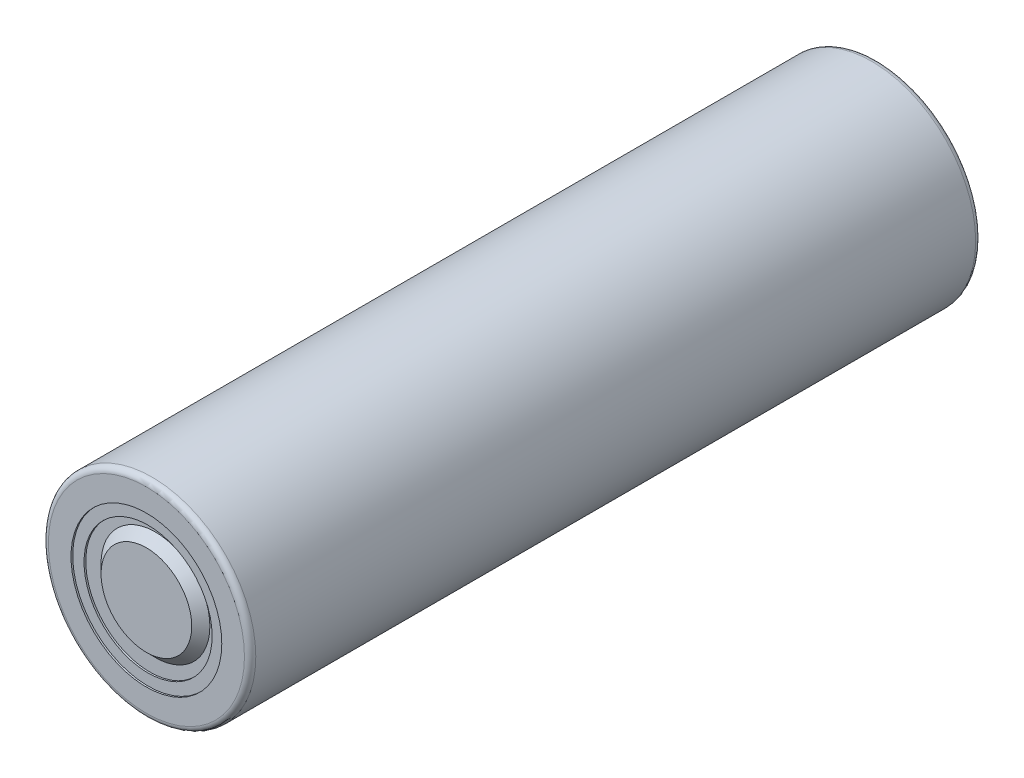
ISO-10303-21;
HEADER;
FILE_DESCRIPTION(('STEP AP214'),'2;1');
FILE_NAME('part.step','',(''),(''),'','','');
FILE_SCHEMA(('AUTOMOTIVE_DESIGN { 1 0 10303 214 1 1 1 1 }'));
ENDSEC;
DATA;
#1=APPLICATION_CONTEXT('core data for automotive mechanical design processes');
#2=APPLICATION_PROTOCOL_DEFINITION('international standard','automotive_design',2000,#1);
#3=PRODUCT_CONTEXT('',#1,'mechanical');
#4=PRODUCT('Part','Part','',(#3));
#5=PRODUCT_RELATED_PRODUCT_CATEGORY('part','',(#4));
#6=PRODUCT_DEFINITION_FORMATION('','',#4);
#7=PRODUCT_DEFINITION_CONTEXT('part definition',#1,'design');
#8=PRODUCT_DEFINITION('design','',#6,#7);
#9=PRODUCT_DEFINITION_SHAPE('','',#8);
#10=(LENGTH_UNIT() NAMED_UNIT(*) SI_UNIT(.MILLI.,.METRE.));
#11=(NAMED_UNIT(*) PLANE_ANGLE_UNIT() SI_UNIT($,.RADIAN.));
#12=(NAMED_UNIT(*) SI_UNIT($,.STERADIAN.) SOLID_ANGLE_UNIT());
#13=UNCERTAINTY_MEASURE_WITH_UNIT(LENGTH_MEASURE(1.E-05),#10,'distance_accuracy_value','');
#14=(GEOMETRIC_REPRESENTATION_CONTEXT(3) GLOBAL_UNCERTAINTY_ASSIGNED_CONTEXT((#13)) GLOBAL_UNIT_ASSIGNED_CONTEXT((#10,
#11,#12)) REPRESENTATION_CONTEXT('',''));
#15=CARTESIAN_POINT('',(0.,0.,0.));
#16=DIRECTION('',(0.,0.,1.));
#17=DIRECTION('',(1.,0.,0.));
#18=AXIS2_PLACEMENT_3D('',#15,#16,#17);
#19=CARTESIAN_POINT('',(0.,0.,64.5));
#20=DIRECTION('',(0.,0.,-1.));
#21=DIRECTION('',(-1.,0.,0.));
#22=AXIS2_PLACEMENT_3D('',#19,#20,#21);
#23=CYLINDRICAL_SURFACE('',#22,9.1499999984872);
#24=CARTESIAN_POINT('',(0.,0.,0.5));
#25=DIRECTION('',(0.,0.,1.));
#26=DIRECTION('',(1.,0.,0.));
#27=AXIS2_PLACEMENT_3D('',#24,#25,#26);
#28=CIRCLE('',#27,9.1499999984872);
#29=CARTESIAN_POINT('',(9.1499999984872,0.,0.5));
#30=VERTEX_POINT('',#29);
#31=EDGE_CURVE('E44',#30,#30,#28,.T.);
#32=ORIENTED_EDGE('',*,*,#31,.T.);
#33=EDGE_LOOP('',(#32));
#34=FACE_BOUND('',#33,.T.);
#35=CARTESIAN_POINT('',(0.,0.,64.));
#36=DIRECTION('',(0.,0.,1.));
#37=DIRECTION('',(1.,0.,0.));
#38=AXIS2_PLACEMENT_3D('',#35,#36,#37);
#39=CIRCLE('',#38,9.1499999984872);
#40=CARTESIAN_POINT('',(9.1499999984872,0.,64.));
#41=VERTEX_POINT('',#40);
#42=EDGE_CURVE('E48',#41,#41,#39,.F.);
#43=ORIENTED_EDGE('',*,*,#42,.T.);
#44=EDGE_LOOP('',(#43));
#45=FACE_BOUND('',#44,.T.);
#46=ADVANCED_FACE('F33',(#34,#45),#23,.T.);
#47=CARTESIAN_POINT('',(0.,0.,64.5));
#48=DIRECTION('',(0.,0.,1.));
#49=DIRECTION('',(1.,0.,0.));
#50=AXIS2_PLACEMENT_3D('',#47,#48,#49);
#51=PLANE('',#50);
#52=CARTESIAN_POINT('',(0.,0.,64.5));
#53=DIRECTION('',(0.,0.,1.));
#54=DIRECTION('',(1.,0.,0.));
#55=AXIS2_PLACEMENT_3D('',#52,#53,#54);
#56=CIRCLE('',#55,8.6499999984872);
#57=CARTESIAN_POINT('',(8.6499999984872,0.,64.5));
#58=VERTEX_POINT('',#57);
#59=EDGE_CURVE('E10',#58,#58,#56,.T.);
#60=ORIENTED_EDGE('',*,*,#59,.T.);
#61=EDGE_LOOP('',(#60));
#62=FACE_BOUND('',#61,.T.);
#63=CARTESIAN_POINT('',(0.,0.,64.5));
#64=DIRECTION('',(0.,0.,1.));
#65=DIRECTION('',(1.,0.,0.));
#66=AXIS2_PLACEMENT_3D('',#63,#64,#65);
#67=CIRCLE('',#66,6.65000000132933);
#68=CARTESIAN_POINT('',(6.65000000132933,0.,64.5));
#69=VERTEX_POINT('',#68);
#70=EDGE_CURVE('E71',#69,#69,#67,.T.);
#71=ORIENTED_EDGE('',*,*,#70,.F.);
#72=EDGE_LOOP('',(#71));
#73=FACE_BOUND('',#72,.T.);
#74=ADVANCED_FACE('F100',(#62,#73),#51,.T.);
#75=CARTESIAN_POINT('',(0.,0.,0.));
#76=DIRECTION('',(0.,0.,1.));
#77=DIRECTION('',(1.,0.,0.));
#78=AXIS2_PLACEMENT_3D('',#75,#76,#77);
#79=PLANE('',#78);
#80=CARTESIAN_POINT('',(0.,0.,0.));
#81=DIRECTION('',(0.,0.,1.));
#82=DIRECTION('',(1.,0.,0.));
#83=AXIS2_PLACEMENT_3D('',#80,#81,#82);
#84=CIRCLE('',#83,8.6499999984872);
#85=CARTESIAN_POINT('',(8.6499999984872,0.,0.));
#86=VERTEX_POINT('',#85);
#87=EDGE_CURVE('E40',#86,#86,#84,.F.);
#88=ORIENTED_EDGE('',*,*,#87,.T.);
#89=EDGE_LOOP('',(#88));
#90=FACE_BOUND('',#89,.T.);
#91=CARTESIAN_POINT('',(0.,0.,0.));
#92=DIRECTION('',(0.,0.,1.));
#93=DIRECTION('',(1.,0.,0.));
#94=AXIS2_PLACEMENT_3D('',#91,#92,#93);
#95=CIRCLE('',#94,7.14999999952627);
#96=CARTESIAN_POINT('',(7.14999999952627,0.,0.));
#97=VERTEX_POINT('',#96);
#98=EDGE_CURVE('E54',#97,#97,#95,.T.);
#99=ORIENTED_EDGE('',*,*,#98,.T.);
#100=EDGE_LOOP('',(#99));
#101=FACE_BOUND('',#100,.T.);
#102=ADVANCED_FACE('F110',(#90,#101),#79,.F.);
#103=CARTESIAN_POINT('',(0.,0.,0.2));
#104=DIRECTION('',(0.,0.,-1.));
#105=DIRECTION('',(-1.,0.,0.));
#106=AXIS2_PLACEMENT_3D('',#103,#104,#105);
#107=CYLINDRICAL_SURFACE('',#106,7.14999999952627);
#108=CARTESIAN_POINT('',(0.,0.,0.2));
#109=DIRECTION('',(0.,0.,1.));
#110=DIRECTION('',(1.,0.,0.));
#111=AXIS2_PLACEMENT_3D('',#108,#109,#110);
#112=CIRCLE('',#111,7.14999999952627);
#113=CARTESIAN_POINT('',(7.14999999952627,0.,0.2));
#114=VERTEX_POINT('',#113);
#115=EDGE_CURVE('E53',#114,#114,#112,.T.);
#116=ORIENTED_EDGE('',*,*,#115,.T.);
#117=EDGE_LOOP('',(#116));
#118=FACE_BOUND('',#117,.T.);
#119=ORIENTED_EDGE('',*,*,#98,.F.);
#120=EDGE_LOOP('',(#119));
#121=FACE_BOUND('',#120,.T.);
#122=ADVANCED_FACE('F139',(#118,#121),#107,.F.);
#123=CARTESIAN_POINT('',(0.,0.,0.2));
#124=DIRECTION('',(0.,0.,1.));
#125=DIRECTION('',(1.,0.,0.));
#126=AXIS2_PLACEMENT_3D('',#123,#124,#125);
#127=PLANE('',#126);
#128=ORIENTED_EDGE('',*,*,#115,.F.);
#129=EDGE_LOOP('',(#128));
#130=FACE_BOUND('',#129,.T.);
#131=ADVANCED_FACE('F217',(#130),#127,.F.);
#132=CARTESIAN_POINT('',(-5.64999999876227,0.,64.2));
#133=DIRECTION('',(0.,0.,-1.));
#134=DIRECTION('',(-1.,0.,0.));
#135=AXIS2_PLACEMENT_3D('',#132,#133,#134);
#136=PLANE('',#135);
#137=CARTESIAN_POINT('',(0.,0.,64.2));
#138=DIRECTION('',(0.,0.,1.));
#139=DIRECTION('',(1.,0.,0.));
#140=AXIS2_PLACEMENT_3D('',#137,#138,#139);
#141=CIRCLE('',#140,5.64999999876227);
#142=CARTESIAN_POINT('',(5.64999999876227,0.,64.2));
#143=VERTEX_POINT('',#142);
#144=EDGE_CURVE('E80',#143,#143,#141,.T.);
#145=ORIENTED_EDGE('',*,*,#144,.T.);
#146=EDGE_LOOP('',(#145));
#147=FACE_BOUND('',#146,.T.);
#148=CARTESIAN_POINT('',(0.,0.,64.2));
#149=DIRECTION('',(0.,0.,1.));
#150=DIRECTION('',(1.,0.,0.));
#151=AXIS2_PLACEMENT_3D('',#148,#149,#150);
#152=CIRCLE('',#151,8.14999999865253);
#153=CARTESIAN_POINT('',(8.14999999865253,0.,64.2));
#154=VERTEX_POINT('',#153);
#155=EDGE_CURVE('E57',#154,#154,#152,.T.);
#156=ORIENTED_EDGE('',*,*,#155,.F.);
#157=EDGE_LOOP('',(#156));
#158=FACE_BOUND('',#157,.T.);
#159=ADVANCED_FACE('F84',(#147,#158),#136,.T.);
#160=CARTESIAN_POINT('',(0.,0.,64.8359201941017));
#161=DIRECTION('',(0.,0.,1.));
#162=DIRECTION('',(1.,0.,0.));
#163=AXIS2_PLACEMENT_3D('',#160,#161,#162);
#164=CYLINDRICAL_SURFACE('',#163,8.14999999865253);
#165=ORIENTED_EDGE('',*,*,#155,.T.);
#166=EDGE_LOOP('',(#165));
#167=FACE_BOUND('',#166,.T.);
#168=CARTESIAN_POINT('',(0.,0.,63.7000000006565));
#169=DIRECTION('',(0.,0.,1.));
#170=DIRECTION('',(1.,0.,0.));
#171=AXIS2_PLACEMENT_3D('',#168,#169,#170);
#172=CIRCLE('',#171,8.14999999865253);
#173=CARTESIAN_POINT('',(8.14999999865253,0.,63.7000000006565));
#174=VERTEX_POINT('',#173);
#175=EDGE_CURVE('E62',#174,#174,#172,.T.);
#176=ORIENTED_EDGE('',*,*,#175,.F.);
#177=EDGE_LOOP('',(#176));
#178=FACE_BOUND('',#177,.T.);
#179=ADVANCED_FACE('F199',(#167,#178),#164,.F.);
#180=CARTESIAN_POINT('',(-8.14999999865253,0.,63.7000000006565));
#181=DIRECTION('',(0.,0.,1.));
#182=DIRECTION('',(1.,0.,0.));
#183=AXIS2_PLACEMENT_3D('',#180,#181,#182);
#184=PLANE('',#183);
#185=ORIENTED_EDGE('',*,*,#175,.T.);
#186=EDGE_LOOP('',(#185));
#187=FACE_BOUND('',#186,.T.);
#188=CARTESIAN_POINT('',(0.,0.,63.7000000006565));
#189=DIRECTION('',(0.,0.,1.));
#190=DIRECTION('',(1.,0.,0.));
#191=AXIS2_PLACEMENT_3D('',#188,#189,#190);
#192=CIRCLE('',#191,4.79999999868218);
#193=CARTESIAN_POINT('',(4.79999999868218,0.,63.7000000006565));
#194=VERTEX_POINT('',#193);
#195=EDGE_CURVE('E65',#194,#194,#192,.T.);
#196=ORIENTED_EDGE('',*,*,#195,.F.);
#197=EDGE_LOOP('',(#196));
#198=FACE_BOUND('',#197,.T.);
#199=ADVANCED_FACE('F189',(#187,#198),#184,.T.);
#200=CARTESIAN_POINT('',(0.,0.,64.5));
#201=DIRECTION('',(0.,0.,-1.));
#202=DIRECTION('',(-1.,0.,0.));
#203=AXIS2_PLACEMENT_3D('',#200,#201,#202);
#204=CONICAL_SURFACE('',#203,3.99999999933866,0.785398163397448);
#205=ORIENTED_EDGE('',*,*,#195,.T.);
#206=EDGE_LOOP('',(#205));
#207=FACE_BOUND('',#206,.T.);
#208=CARTESIAN_POINT('',(0.,0.,64.5));
#209=DIRECTION('',(0.,0.,1.));
#210=DIRECTION('',(1.,0.,0.));
#211=AXIS2_PLACEMENT_3D('',#208,#209,#210);
#212=CIRCLE('',#211,3.99999999933866);
#213=CARTESIAN_POINT('',(3.99999999933866,0.,64.5));
#214=VERTEX_POINT('',#213);
#215=EDGE_CURVE('E68',#214,#214,#212,.T.);
#216=ORIENTED_EDGE('',*,*,#215,.F.);
#217=EDGE_LOOP('',(#216));
#218=FACE_BOUND('',#217,.T.);
#219=ADVANCED_FACE('F179',(#207,#218),#204,.T.);
#220=CARTESIAN_POINT('',(0.,0.,64.8359201941017));
#221=DIRECTION('',(0.,0.,1.));
#222=DIRECTION('',(1.,0.,0.));
#223=AXIS2_PLACEMENT_3D('',#220,#221,#222);
#224=CYLINDRICAL_SURFACE('',#223,6.65000000132933);
#225=ORIENTED_EDGE('',*,*,#70,.T.);
#226=EDGE_LOOP('',(#225));
#227=FACE_BOUND('',#226,.T.);
#228=CARTESIAN_POINT('',(0.,0.,64.35));
#229=DIRECTION('',(0.,0.,1.));
#230=DIRECTION('',(1.,0.,0.));
#231=AXIS2_PLACEMENT_3D('',#228,#229,#230);
#232=CIRCLE('',#231,6.65000000132933);
#233=CARTESIAN_POINT('',(6.65000000132933,0.,64.35));
#234=VERTEX_POINT('',#233);
#235=EDGE_CURVE('E74',#234,#234,#232,.T.);
#236=ORIENTED_EDGE('',*,*,#235,.F.);
#237=EDGE_LOOP('',(#236));
#238=FACE_BOUND('',#237,.T.);
#239=ADVANCED_FACE('F101',(#227,#238),#224,.F.);
#240=CARTESIAN_POINT('',(-6.65000000132933,0.,64.35));
#241=DIRECTION('',(0.,0.,1.));
#242=DIRECTION('',(1.,0.,0.));
#243=AXIS2_PLACEMENT_3D('',#240,#241,#242);
#244=PLANE('',#243);
#245=ORIENTED_EDGE('',*,*,#235,.T.);
#246=EDGE_LOOP('',(#245));
#247=FACE_BOUND('',#246,.T.);
#248=CARTESIAN_POINT('',(0.,0.,64.35));
#249=DIRECTION('',(0.,0.,1.));
#250=DIRECTION('',(1.,0.,0.));
#251=AXIS2_PLACEMENT_3D('',#248,#249,#250);
#252=CIRCLE('',#251,5.64999999876227);
#253=CARTESIAN_POINT('',(5.64999999876227,0.,64.35));
#254=VERTEX_POINT('',#253);
#255=EDGE_CURVE('E77',#254,#254,#252,.T.);
#256=ORIENTED_EDGE('',*,*,#255,.F.);
#257=EDGE_LOOP('',(#256));
#258=FACE_BOUND('',#257,.T.);
#259=ADVANCED_FACE('F90',(#247,#258),#244,.T.);
#260=CARTESIAN_POINT('',(0.,0.,64.8359201941017));
#261=DIRECTION('',(0.,0.,1.));
#262=DIRECTION('',(1.,0.,0.));
#263=AXIS2_PLACEMENT_3D('',#260,#261,#262);
#264=CYLINDRICAL_SURFACE('',#263,5.64999999876227);
#265=ORIENTED_EDGE('',*,*,#255,.T.);
#266=EDGE_LOOP('',(#265));
#267=FACE_BOUND('',#266,.T.);
#268=ORIENTED_EDGE('',*,*,#144,.F.);
#269=EDGE_LOOP('',(#268));
#270=FACE_BOUND('',#269,.T.);
#271=ADVANCED_FACE('F87',(#267,#270),#264,.F.);
#272=ORIENTED_EDGE('',*,*,#215,.T.);
#273=EDGE_LOOP('',(#272));
#274=FACE_BOUND('',#273,.T.);
#275=ADVANCED_FACE('F89',(#274),#51,.T.);
#276=CARTESIAN_POINT('',(0.,0.,0.5));
#277=DIRECTION('',(0.,0.,1.));
#278=DIRECTION('',(1.,0.,0.));
#279=AXIS2_PLACEMENT_3D('',#276,#277,#278);
#280=TOROIDAL_SURFACE('',#279,8.6499999984872,0.5);
#281=ORIENTED_EDGE('',*,*,#87,.F.);
#282=EDGE_LOOP('',(#281));
#283=FACE_BOUND('',#282,.T.);
#284=ORIENTED_EDGE('',*,*,#31,.F.);
#285=EDGE_LOOP('',(#284));
#286=FACE_BOUND('',#285,.T.);
#287=ADVANCED_FACE('F97',(#283,#286),#280,.T.);
#288=CARTESIAN_POINT('',(0.,0.,64.));
#289=DIRECTION('',(0.,0.,1.));
#290=DIRECTION('',(1.,0.,0.));
#291=AXIS2_PLACEMENT_3D('',#288,#289,#290);
#292=TOROIDAL_SURFACE('',#291,8.6499999984872,0.5);
#293=ORIENTED_EDGE('',*,*,#42,.F.);
#294=EDGE_LOOP('',(#293));
#295=FACE_BOUND('',#294,.T.);
#296=ORIENTED_EDGE('',*,*,#59,.F.);
#297=EDGE_LOOP('',(#296));
#298=FACE_BOUND('',#297,.T.);
#299=ADVANCED_FACE('F35',(#295,#298),#292,.T.);
#300=CLOSED_SHELL('',(#46,#74,#102,#122,#131,#159,#179,#199,#219,#239,#259,#271,#275,#287,#299));
#301=MANIFOLD_SOLID_BREP('B2',#300);
#302=ADVANCED_BREP_SHAPE_REPRESENTATION('',(#18,#301),#14);
#303=SHAPE_DEFINITION_REPRESENTATION(#9,#302);
ENDSEC;
END-ISO-10303-21;
